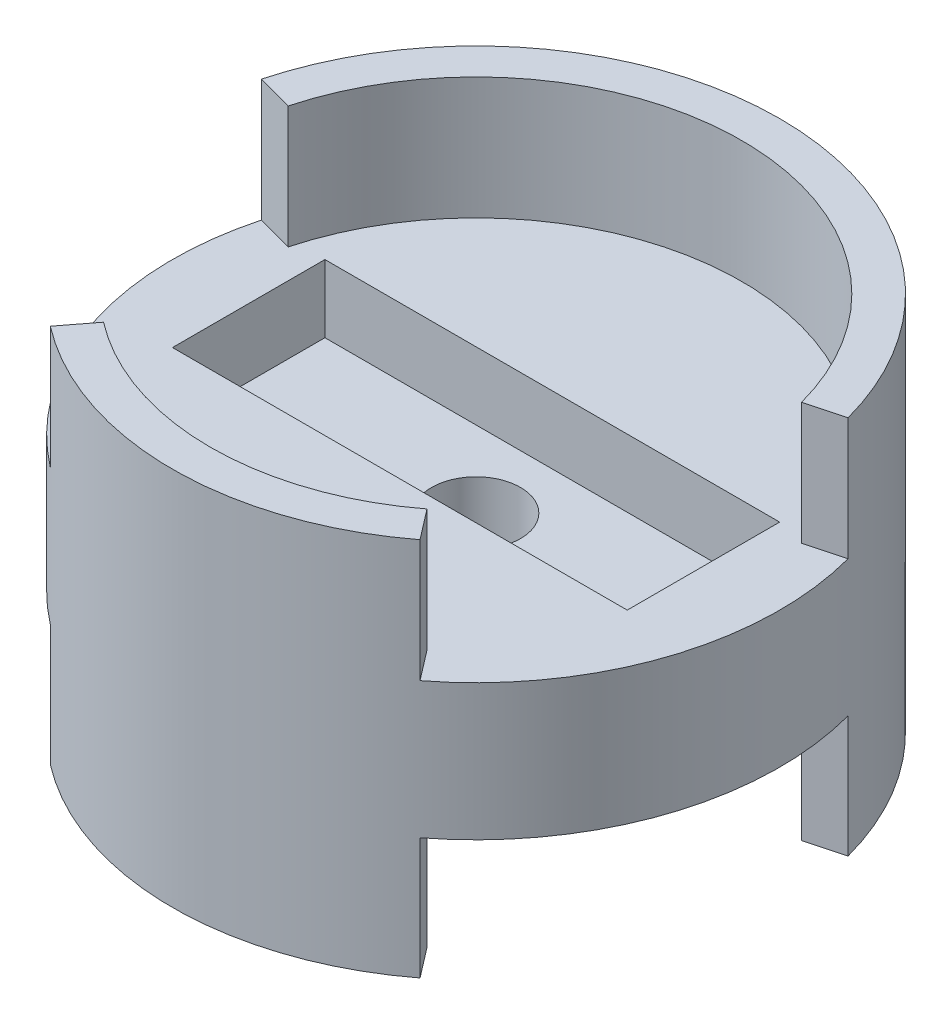
ISO-10303-21;
HEADER;
FILE_DESCRIPTION(('STEP AP214'),'2;1');
FILE_NAME('part.step','',(''),(''),'','','');
FILE_SCHEMA(('AUTOMOTIVE_DESIGN { 1 0 10303 214 1 1 1 1 }'));
ENDSEC;
DATA;
#1=APPLICATION_CONTEXT('core data for automotive mechanical design processes');
#2=APPLICATION_PROTOCOL_DEFINITION('international standard','automotive_design',2000,#1);
#3=PRODUCT_CONTEXT('',#1,'mechanical');
#4=PRODUCT('Part','Part','',(#3));
#5=PRODUCT_RELATED_PRODUCT_CATEGORY('part','',(#4));
#6=PRODUCT_DEFINITION_FORMATION('','',#4);
#7=PRODUCT_DEFINITION_CONTEXT('part definition',#1,'design');
#8=PRODUCT_DEFINITION('design','',#6,#7);
#9=PRODUCT_DEFINITION_SHAPE('','',#8);
#10=(LENGTH_UNIT() NAMED_UNIT(*) SI_UNIT(.MILLI.,.METRE.));
#11=(NAMED_UNIT(*) PLANE_ANGLE_UNIT() SI_UNIT($,.RADIAN.));
#12=(NAMED_UNIT(*) SI_UNIT($,.STERADIAN.) SOLID_ANGLE_UNIT());
#13=UNCERTAINTY_MEASURE_WITH_UNIT(LENGTH_MEASURE(1.E-05),#10,'distance_accuracy_value','');
#14=(GEOMETRIC_REPRESENTATION_CONTEXT(3) GLOBAL_UNCERTAINTY_ASSIGNED_CONTEXT((#13)) GLOBAL_UNIT_ASSIGNED_CONTEXT((#10,
#11,#12)) REPRESENTATION_CONTEXT('',''));
#15=CARTESIAN_POINT('',(0.,0.,0.));
#16=DIRECTION('',(0.,0.,1.));
#17=DIRECTION('',(1.,0.,0.));
#18=AXIS2_PLACEMENT_3D('',#15,#16,#17);
#19=CARTESIAN_POINT('',(0.,5.6642,0.));
#20=DIRECTION('',(0.,1.,0.));
#21=DIRECTION('',(0.,0.,1.));
#22=AXIS2_PLACEMENT_3D('',#19,#20,#21);
#23=PLANE('',#22);
#24=DIRECTION('',(-1.,0.,0.));
#25=VECTOR('',#24,1.);
#26=CARTESIAN_POINT('',(0.,5.6642,6.3754));
#27=LINE('',#26,#25);
#28=CARTESIAN_POINT('',(19.01825,5.6642,6.3754));
#29=VERTEX_POINT('',#28);
#30=CARTESIAN_POINT('',(-19.01825,5.6642,6.3754));
#31=VERTEX_POINT('',#30);
#32=EDGE_CURVE('E278',#29,#31,#27,.T.);
#33=ORIENTED_EDGE('',*,*,#32,.T.);
#34=DIRECTION('',(0.,0.,-1.));
#35=VECTOR('',#34,1.);
#36=CARTESIAN_POINT('',(-19.01825,5.6642,0.));
#37=LINE('',#36,#35);
#38=CARTESIAN_POINT('',(-19.01825,5.6642,-6.3754));
#39=VERTEX_POINT('',#38);
#40=EDGE_CURVE('E281',#31,#39,#37,.T.);
#41=ORIENTED_EDGE('',*,*,#40,.T.);
#42=DIRECTION('',(-1.,0.,0.));
#43=VECTOR('',#42,1.);
#44=CARTESIAN_POINT('',(0.,5.6642,-6.3754));
#45=LINE('',#44,#43);
#46=CARTESIAN_POINT('',(19.01825,5.6642,-6.3754));
#47=VERTEX_POINT('',#46);
#48=EDGE_CURVE('E284',#47,#39,#45,.T.);
#49=ORIENTED_EDGE('',*,*,#48,.F.);
#50=DIRECTION('',(0.,0.,-1.));
#51=VECTOR('',#50,1.);
#52=CARTESIAN_POINT('',(19.01825,5.6642,0.));
#53=LINE('',#52,#51);
#54=EDGE_CURVE('E287',#29,#47,#53,.T.);
#55=ORIENTED_EDGE('',*,*,#54,.F.);
#56=EDGE_LOOP('',(#33,#41,#49,#55));
#57=FACE_BOUND('',#56,.T.);
#58=CARTESIAN_POINT('',(0.,5.6642,0.));
#59=DIRECTION('',(0.,1.,0.));
#60=DIRECTION('',(0.,0.,1.));
#61=AXIS2_PLACEMENT_3D('',#58,#59,#60);
#62=CIRCLE('',#61,25.4);
#63=CARTESIAN_POINT('',(-24.5345159877424,5.6642,-6.57400374560395));
#64=VERTEX_POINT('',#63);
#65=CARTESIAN_POINT('',(-15.4625402968215,5.6642,20.1511748433973));
#66=VERTEX_POINT('',#65);
#67=EDGE_CURVE('E291',#64,#66,#62,.T.);
#68=ORIENTED_EDGE('',*,*,#67,.T.);
#69=DIRECTION('',(0.608761429008722,0.,-0.793353340291234));
#70=VECTOR('',#69,1.);
#71=CARTESIAN_POINT('',(0.,5.6642,0.));
#72=LINE('',#71,#70);
#73=CARTESIAN_POINT('',(-13.5297227597188,5.6642,17.6322779879727));
#74=VERTEX_POINT('',#73);
#75=EDGE_CURVE('E53',#66,#74,#72,.T.);
#76=ORIENTED_EDGE('',*,*,#75,.T.);
#77=CARTESIAN_POINT('',(0.,5.6642,0.));
#78=DIRECTION('',(0.,1.,0.));
#79=DIRECTION('',(0.,0.,1.));
#80=AXIS2_PLACEMENT_3D('',#77,#78,#79);
#81=CIRCLE('',#80,22.225);
#82=CARTESIAN_POINT('',(13.5297227597188,5.6642,17.6322779879727));
#83=VERTEX_POINT('',#82);
#84=EDGE_CURVE('E219',#83,#74,#81,.F.);
#85=ORIENTED_EDGE('',*,*,#84,.F.);
#86=DIRECTION('',(-0.608761429008722,0.,-0.793353340291234));
#87=VECTOR('',#86,1.);
#88=CARTESIAN_POINT('',(0.,5.6642,0.));
#89=LINE('',#88,#87);
#90=CARTESIAN_POINT('',(15.4625402968215,5.6642,20.1511748433973));
#91=VERTEX_POINT('',#90);
#92=EDGE_CURVE('E200',#91,#83,#89,.T.);
#93=ORIENTED_EDGE('',*,*,#92,.F.);
#94=CARTESIAN_POINT('',(24.5345159877424,5.6642,-6.57400374560395));
#95=VERTEX_POINT('',#94);
#96=EDGE_CURVE('E290',#91,#95,#62,.T.);
#97=ORIENTED_EDGE('',*,*,#96,.T.);
#98=DIRECTION('',(-0.965925826289069,0.,0.258819045102518));
#99=VECTOR('',#98,1.);
#100=CARTESIAN_POINT('',(0.,5.6642,0.));
#101=LINE('',#100,#99);
#102=CARTESIAN_POINT('',(21.4677014892746,5.6642,-5.75225327740346));
#103=VERTEX_POINT('',#102);
#104=EDGE_CURVE('E262',#95,#103,#101,.T.);
#105=ORIENTED_EDGE('',*,*,#104,.T.);
#106=CARTESIAN_POINT('',(0.,5.6642,0.));
#107=DIRECTION('',(0.,1.,0.));
#108=DIRECTION('',(0.,0.,1.));
#109=AXIS2_PLACEMENT_3D('',#106,#107,#108);
#110=CIRCLE('',#109,22.225);
#111=CARTESIAN_POINT('',(-21.4677014892746,5.6642,-5.75225327740346));
#112=VERTEX_POINT('',#111);
#113=EDGE_CURVE('E264',#112,#103,#110,.F.);
#114=ORIENTED_EDGE('',*,*,#113,.F.);
#115=DIRECTION('',(0.965925826289069,0.,0.258819045102518));
#116=VECTOR('',#115,1.);
#117=CARTESIAN_POINT('',(0.,5.6642,0.));
#118=LINE('',#117,#116);
#119=EDGE_CURVE('E247',#64,#112,#118,.T.);
#120=ORIENTED_EDGE('',*,*,#119,.F.);
#121=EDGE_LOOP('',(#68,#76,#85,#93,#97,#105,#114,#120));
#122=FACE_BOUND('',#121,.T.);
#123=ADVANCED_FACE('F38',(#57,#122),#23,.T.);
#124=CARTESIAN_POINT('',(0.,-5.715,0.));
#125=DIRECTION('',(0.,1.,0.));
#126=DIRECTION('',(0.,0.,1.));
#127=AXIS2_PLACEMENT_3D('',#124,#125,#126);
#128=PLANE('',#127);
#129=CARTESIAN_POINT('',(0.,-5.715,0.));
#130=DIRECTION('',(0.,1.,0.));
#131=DIRECTION('',(0.,0.,1.));
#132=AXIS2_PLACEMENT_3D('',#129,#130,#131);
#133=CIRCLE('',#132,3.71475);
#134=CARTESIAN_POINT('',(0.,-5.715,3.71475));
#135=VERTEX_POINT('',#134);
#136=EDGE_CURVE('E271',#135,#135,#133,.T.);
#137=ORIENTED_EDGE('',*,*,#136,.T.);
#138=EDGE_LOOP('',(#137));
#139=FACE_BOUND('',#138,.T.);
#140=DIRECTION('',(0.608761429008722,0.,-0.793353340291234));
#141=VECTOR('',#140,1.);
#142=CARTESIAN_POINT('',(0.,-5.715,0.));
#143=LINE('',#142,#141);
#144=CARTESIAN_POINT('',(-15.4625402968215,-5.71499999999999,20.1511748433974));
#145=VERTEX_POINT('',#144);
#146=CARTESIAN_POINT('',(-13.5297227597188,-5.715,17.6322779879727));
#147=VERTEX_POINT('',#146);
#148=EDGE_CURVE('E181',#145,#147,#143,.T.);
#149=ORIENTED_EDGE('',*,*,#148,.F.);
#150=CARTESIAN_POINT('',(0.,-5.715,0.));
#151=DIRECTION('',(0.,1.,0.));
#152=DIRECTION('',(0.,0.,1.));
#153=AXIS2_PLACEMENT_3D('',#150,#151,#152);
#154=CIRCLE('',#153,25.4);
#155=CARTESIAN_POINT('',(-24.5345159877424,-5.715,-6.57400374560395));
#156=VERTEX_POINT('',#155);
#157=EDGE_CURVE('E268',#156,#145,#154,.T.);
#158=ORIENTED_EDGE('',*,*,#157,.F.);
#159=DIRECTION('',(0.965925826289069,0.,0.258819045102518));
#160=VECTOR('',#159,1.);
#161=CARTESIAN_POINT('',(0.,-5.715,0.));
#162=LINE('',#161,#160);
#163=CARTESIAN_POINT('',(-21.4677014892746,-5.715,-5.75225327740346));
#164=VERTEX_POINT('',#163);
#165=EDGE_CURVE('E313',#156,#164,#162,.T.);
#166=ORIENTED_EDGE('',*,*,#165,.T.);
#167=CARTESIAN_POINT('',(0.,-5.715,0.));
#168=DIRECTION('',(0.,1.,0.));
#169=DIRECTION('',(0.,0.,1.));
#170=AXIS2_PLACEMENT_3D('',#167,#168,#169);
#171=CIRCLE('',#170,22.225);
#172=CARTESIAN_POINT('',(21.4677014892746,-5.715,-5.75225327740346));
#173=VERTEX_POINT('',#172);
#174=EDGE_CURVE('E316',#164,#173,#171,.F.);
#175=ORIENTED_EDGE('',*,*,#174,.T.);
#176=DIRECTION('',(-0.965925826289069,0.,0.258819045102518));
#177=VECTOR('',#176,1.);
#178=CARTESIAN_POINT('',(0.,-5.715,0.));
#179=LINE('',#178,#177);
#180=CARTESIAN_POINT('',(24.5345159877424,-5.715,-6.57400374560395));
#181=VERTEX_POINT('',#180);
#182=EDGE_CURVE('E46',#181,#173,#179,.T.);
#183=ORIENTED_EDGE('',*,*,#182,.F.);
#184=CARTESIAN_POINT('',(15.4625402968215,-5.71499999999999,20.1511748433974));
#185=VERTEX_POINT('',#184);
#186=EDGE_CURVE('E272',#185,#181,#154,.T.);
#187=ORIENTED_EDGE('',*,*,#186,.F.);
#188=DIRECTION('',(-0.608761429008722,0.,-0.793353340291234));
#189=VECTOR('',#188,1.);
#190=CARTESIAN_POINT('',(0.,-5.715,0.));
#191=LINE('',#190,#189);
#192=CARTESIAN_POINT('',(13.5297227597188,-5.715,17.6322779879727));
#193=VERTEX_POINT('',#192);
#194=EDGE_CURVE('E196',#185,#193,#191,.T.);
#195=ORIENTED_EDGE('',*,*,#194,.T.);
#196=CARTESIAN_POINT('',(0.,-5.715,0.));
#197=DIRECTION('',(0.,1.,0.));
#198=DIRECTION('',(0.,0.,1.));
#199=AXIS2_PLACEMENT_3D('',#196,#197,#198);
#200=CIRCLE('',#199,22.225);
#201=EDGE_CURVE('E11',#193,#147,#200,.F.);
#202=ORIENTED_EDGE('',*,*,#201,.T.);
#203=EDGE_LOOP('',(#149,#158,#166,#175,#183,#187,#195,#202));
#204=FACE_BOUND('',#203,.T.);
#205=ADVANCED_FACE('F330',(#139,#204),#128,.F.);
#206=CARTESIAN_POINT('',(0.,5.6642,6.3754));
#207=DIRECTION('',(0.,0.,1.));
#208=DIRECTION('',(1.,0.,0.));
#209=AXIS2_PLACEMENT_3D('',#206,#207,#208);
#210=PLANE('',#209);
#211=DIRECTION('',(-1.,0.,0.));
#212=VECTOR('',#211,1.);
#213=CARTESIAN_POINT('',(0.,0.,6.3754));
#214=LINE('',#213,#212);
#215=CARTESIAN_POINT('',(19.01825,0.,6.3754));
#216=VERTEX_POINT('',#215);
#217=CARTESIAN_POINT('',(-19.01825,0.,6.3754));
#218=VERTEX_POINT('',#217);
#219=EDGE_CURVE('E275',#216,#218,#214,.T.);
#220=ORIENTED_EDGE('',*,*,#219,.T.);
#221=DIRECTION('',(0.,-1.,0.));
#222=VECTOR('',#221,1.);
#223=CARTESIAN_POINT('',(-19.01825,5.6642,6.3754));
#224=LINE('',#223,#222);
#225=EDGE_CURVE('E310',#31,#218,#224,.T.);
#226=ORIENTED_EDGE('',*,*,#225,.F.);
#227=ORIENTED_EDGE('',*,*,#32,.F.);
#228=DIRECTION('',(0.,-1.,0.));
#229=VECTOR('',#228,1.);
#230=CARTESIAN_POINT('',(19.01825,5.6642,6.3754));
#231=LINE('',#230,#229);
#232=EDGE_CURVE('E293',#29,#216,#231,.T.);
#233=ORIENTED_EDGE('',*,*,#232,.T.);
#234=EDGE_LOOP('',(#220,#226,#227,#233));
#235=FACE_BOUND('',#234,.T.);
#236=ADVANCED_FACE('F40',(#235),#210,.F.);
#237=CARTESIAN_POINT('',(-19.01825,5.6642,0.));
#238=DIRECTION('',(-1.,0.,0.));
#239=DIRECTION('',(0.,0.,1.));
#240=AXIS2_PLACEMENT_3D('',#237,#238,#239);
#241=PLANE('',#240);
#242=DIRECTION('',(0.,0.,-1.));
#243=VECTOR('',#242,1.);
#244=CARTESIAN_POINT('',(-19.01825,0.,0.));
#245=LINE('',#244,#243);
#246=CARTESIAN_POINT('',(-19.01825,0.,-6.3754));
#247=VERTEX_POINT('',#246);
#248=EDGE_CURVE('E296',#218,#247,#245,.T.);
#249=ORIENTED_EDGE('',*,*,#248,.T.);
#250=DIRECTION('',(0.,-1.,0.));
#251=VECTOR('',#250,1.);
#252=CARTESIAN_POINT('',(-19.01825,5.6642,-6.3754));
#253=LINE('',#252,#251);
#254=EDGE_CURVE('E307',#39,#247,#253,.T.);
#255=ORIENTED_EDGE('',*,*,#254,.F.);
#256=ORIENTED_EDGE('',*,*,#40,.F.);
#257=ORIENTED_EDGE('',*,*,#225,.T.);
#258=EDGE_LOOP('',(#249,#255,#256,#257));
#259=FACE_BOUND('',#258,.T.);
#260=ADVANCED_FACE('F374',(#259),#241,.F.);
#261=CARTESIAN_POINT('',(0.,5.6642,-6.3754));
#262=DIRECTION('',(0.,0.,1.));
#263=DIRECTION('',(1.,0.,0.));
#264=AXIS2_PLACEMENT_3D('',#261,#262,#263);
#265=PLANE('',#264);
#266=DIRECTION('',(-1.,0.,0.));
#267=VECTOR('',#266,1.);
#268=CARTESIAN_POINT('',(0.,0.,-6.3754));
#269=LINE('',#268,#267);
#270=CARTESIAN_POINT('',(19.01825,0.,-6.3754));
#271=VERTEX_POINT('',#270);
#272=EDGE_CURVE('E299',#271,#247,#269,.T.);
#273=ORIENTED_EDGE('',*,*,#272,.F.);
#274=DIRECTION('',(0.,-1.,0.));
#275=VECTOR('',#274,1.);
#276=CARTESIAN_POINT('',(19.01825,5.6642,-6.3754));
#277=LINE('',#276,#275);
#278=EDGE_CURVE('E304',#47,#271,#277,.T.);
#279=ORIENTED_EDGE('',*,*,#278,.F.);
#280=ORIENTED_EDGE('',*,*,#48,.T.);
#281=ORIENTED_EDGE('',*,*,#254,.T.);
#282=EDGE_LOOP('',(#273,#279,#280,#281));
#283=FACE_BOUND('',#282,.T.);
#284=ADVANCED_FACE('F371',(#283),#265,.T.);
#285=CARTESIAN_POINT('',(19.01825,5.6642,0.));
#286=DIRECTION('',(-1.,0.,0.));
#287=DIRECTION('',(0.,0.,1.));
#288=AXIS2_PLACEMENT_3D('',#285,#286,#287);
#289=PLANE('',#288);
#290=DIRECTION('',(0.,0.,-1.));
#291=VECTOR('',#290,1.);
#292=CARTESIAN_POINT('',(19.01825,0.,0.));
#293=LINE('',#292,#291);
#294=EDGE_CURVE('E282',#216,#271,#293,.T.);
#295=ORIENTED_EDGE('',*,*,#294,.F.);
#296=ORIENTED_EDGE('',*,*,#232,.F.);
#297=ORIENTED_EDGE('',*,*,#54,.T.);
#298=ORIENTED_EDGE('',*,*,#278,.T.);
#299=EDGE_LOOP('',(#295,#296,#297,#298));
#300=FACE_BOUND('',#299,.T.);
#301=ADVANCED_FACE('F368',(#300),#289,.T.);
#302=CARTESIAN_POINT('',(0.,5.6642,0.));
#303=DIRECTION('',(0.,-1.,0.));
#304=DIRECTION('',(0.,0.,-1.));
#305=AXIS2_PLACEMENT_3D('',#302,#303,#304);
#306=CYLINDRICAL_SURFACE('',#305,25.4);
#307=ORIENTED_EDGE('',*,*,#157,.T.);
#308=DIRECTION('',(0.,-1.,0.));
#309=VECTOR('',#308,1.);
#310=CARTESIAN_POINT('',(-15.4625402968215,15.875,20.1511748433974));
#311=LINE('',#310,#309);
#312=CARTESIAN_POINT('',(-15.4625402968215,-15.875,20.1511748433974));
#313=VERTEX_POINT('',#312);
#314=EDGE_CURVE('E516',#145,#313,#311,.T.);
#315=ORIENTED_EDGE('',*,*,#314,.T.);
#316=CARTESIAN_POINT('',(0.,-15.875,0.));
#317=DIRECTION('',(0.,1.,0.));
#318=DIRECTION('',(0.,0.,1.));
#319=AXIS2_PLACEMENT_3D('',#316,#317,#318);
#320=CIRCLE('',#319,25.4);
#321=CARTESIAN_POINT('',(15.4625402968215,-15.875,20.1511748433974));
#322=VERTEX_POINT('',#321);
#323=EDGE_CURVE('E192',#313,#322,#320,.T.);
#324=ORIENTED_EDGE('',*,*,#323,.T.);
#325=DIRECTION('',(0.,-1.,0.));
#326=VECTOR('',#325,1.);
#327=CARTESIAN_POINT('',(15.4625402968215,15.875,20.1511748433974));
#328=LINE('',#327,#326);
#329=EDGE_CURVE('E521',#185,#322,#328,.T.);
#330=ORIENTED_EDGE('',*,*,#329,.F.);
#331=ORIENTED_EDGE('',*,*,#186,.T.);
#332=DIRECTION('',(0.,-1.,0.));
#333=VECTOR('',#332,1.);
#334=CARTESIAN_POINT('',(24.5345159877424,15.875,-6.57400374560395));
#335=LINE('',#334,#333);
#336=CARTESIAN_POINT('',(24.5345159877424,-15.875,-6.57400374560395));
#337=VERTEX_POINT('',#336);
#338=EDGE_CURVE('E252',#181,#337,#335,.T.);
#339=ORIENTED_EDGE('',*,*,#338,.T.);
#340=CARTESIAN_POINT('',(0.,-15.875,0.));
#341=DIRECTION('',(0.,1.,0.));
#342=DIRECTION('',(0.,0.,1.));
#343=AXIS2_PLACEMENT_3D('',#340,#341,#342);
#344=CIRCLE('',#343,25.4);
#345=CARTESIAN_POINT('',(-24.5345159877424,-15.875,-6.57400374560395));
#346=VERTEX_POINT('',#345);
#347=EDGE_CURVE('E239',#337,#346,#344,.T.);
#348=ORIENTED_EDGE('',*,*,#347,.T.);
#349=DIRECTION('',(0.,-1.,0.));
#350=VECTOR('',#349,1.);
#351=CARTESIAN_POINT('',(-24.5345159877424,15.875,-6.57400374560395));
#352=LINE('',#351,#350);
#353=EDGE_CURVE('E256',#156,#346,#352,.T.);
#354=ORIENTED_EDGE('',*,*,#353,.F.);
#355=EDGE_LOOP('',(#307,#315,#324,#330,#331,#339,#348,#354));
#356=FACE_BOUND('',#355,.T.);
#357=ORIENTED_EDGE('',*,*,#96,.F.);
#358=CARTESIAN_POINT('',(15.4625402968215,15.875,20.1511748433974));
#359=VERTEX_POINT('',#358);
#360=EDGE_CURVE('E526',#359,#91,#328,.T.);
#361=ORIENTED_EDGE('',*,*,#360,.F.);
#362=CARTESIAN_POINT('',(0.,15.875,0.));
#363=DIRECTION('',(0.,1.,0.));
#364=DIRECTION('',(0.,0.,1.));
#365=AXIS2_PLACEMENT_3D('',#362,#363,#364);
#366=CIRCLE('',#365,25.4);
#367=CARTESIAN_POINT('',(-15.4625402968215,15.875,20.1511748433974));
#368=VERTEX_POINT('',#367);
#369=EDGE_CURVE('E207',#368,#359,#366,.T.);
#370=ORIENTED_EDGE('',*,*,#369,.F.);
#371=EDGE_CURVE('E518',#368,#66,#311,.T.);
#372=ORIENTED_EDGE('',*,*,#371,.T.);
#373=ORIENTED_EDGE('',*,*,#67,.F.);
#374=CARTESIAN_POINT('',(-24.5345159877424,15.875,-6.57400374560395));
#375=VERTEX_POINT('',#374);
#376=EDGE_CURVE('E253',#375,#64,#352,.T.);
#377=ORIENTED_EDGE('',*,*,#376,.F.);
#378=CARTESIAN_POINT('',(0.,15.875,0.));
#379=DIRECTION('',(0.,1.,0.));
#380=DIRECTION('',(0.,0.,1.));
#381=AXIS2_PLACEMENT_3D('',#378,#379,#380);
#382=CIRCLE('',#381,25.4);
#383=CARTESIAN_POINT('',(24.5345159877424,15.875,-6.57400374560395));
#384=VERTEX_POINT('',#383);
#385=EDGE_CURVE('E229',#384,#375,#382,.T.);
#386=ORIENTED_EDGE('',*,*,#385,.F.);
#387=EDGE_CURVE('E249',#384,#95,#335,.T.);
#388=ORIENTED_EDGE('',*,*,#387,.T.);
#389=EDGE_LOOP('',(#357,#361,#370,#372,#373,#377,#386,#388));
#390=FACE_BOUND('',#389,.T.);
#391=ADVANCED_FACE('F337',(#356,#390),#306,.T.);
#392=CARTESIAN_POINT('',(0.,0.,0.));
#393=DIRECTION('',(0.,1.,0.));
#394=DIRECTION('',(0.,0.,1.));
#395=AXIS2_PLACEMENT_3D('',#392,#393,#394);
#396=PLANE('',#395);
#397=CARTESIAN_POINT('',(0.,0.,0.));
#398=DIRECTION('',(0.,1.,0.));
#399=DIRECTION('',(0.,0.,1.));
#400=AXIS2_PLACEMENT_3D('',#397,#398,#399);
#401=CIRCLE('',#400,3.71475);
#402=CARTESIAN_POINT('',(0.,0.,3.71475));
#403=VERTEX_POINT('',#402);
#404=EDGE_CURVE('E267',#403,#403,#401,.T.);
#405=ORIENTED_EDGE('',*,*,#404,.F.);
#406=EDGE_LOOP('',(#405));
#407=FACE_BOUND('',#406,.T.);
#408=ORIENTED_EDGE('',*,*,#219,.F.);
#409=ORIENTED_EDGE('',*,*,#294,.T.);
#410=ORIENTED_EDGE('',*,*,#272,.T.);
#411=ORIENTED_EDGE('',*,*,#248,.F.);
#412=EDGE_LOOP('',(#408,#409,#410,#411));
#413=FACE_BOUND('',#412,.T.);
#414=ADVANCED_FACE('F351',(#407,#413),#396,.T.);
#415=CARTESIAN_POINT('',(0.,-5.715,0.));
#416=DIRECTION('',(0.,1.,0.));
#417=DIRECTION('',(0.,0.,1.));
#418=AXIS2_PLACEMENT_3D('',#415,#416,#417);
#419=CYLINDRICAL_SURFACE('',#418,3.71475);
#420=ORIENTED_EDGE('',*,*,#136,.F.);
#421=EDGE_LOOP('',(#420));
#422=FACE_BOUND('',#421,.T.);
#423=ORIENTED_EDGE('',*,*,#404,.T.);
#424=EDGE_LOOP('',(#423));
#425=FACE_BOUND('',#424,.T.);
#426=ADVANCED_FACE('F343',(#422,#425),#419,.F.);
#427=CARTESIAN_POINT('',(0.,-15.875,0.));
#428=DIRECTION('',(0.,1.,0.));
#429=DIRECTION('',(0.,0.,1.));
#430=AXIS2_PLACEMENT_3D('',#427,#428,#429);
#431=PLANE('',#430);
#432=CARTESIAN_POINT('',(0.,-15.875,0.));
#433=DIRECTION('',(0.,1.,0.));
#434=DIRECTION('',(0.,0.,1.));
#435=AXIS2_PLACEMENT_3D('',#432,#433,#434);
#436=CIRCLE('',#435,22.225);
#437=CARTESIAN_POINT('',(21.4677014892746,-15.875,-5.75225327740346));
#438=VERTEX_POINT('',#437);
#439=CARTESIAN_POINT('',(-21.4677014892746,-15.875,-5.75225327740346));
#440=VERTEX_POINT('',#439);
#441=EDGE_CURVE('E221',#438,#440,#436,.T.);
#442=ORIENTED_EDGE('',*,*,#441,.T.);
#443=DIRECTION('',(-0.965925826289069,0.,-0.258819045102518));
#444=VECTOR('',#443,1.);
#445=CARTESIAN_POINT('',(-21.4677014892746,-15.875,-5.75225327740346));
#446=LINE('',#445,#444);
#447=EDGE_CURVE('E236',#440,#346,#446,.T.);
#448=ORIENTED_EDGE('',*,*,#447,.T.);
#449=ORIENTED_EDGE('',*,*,#347,.F.);
#450=DIRECTION('',(0.965925826289069,0.,-0.258819045102518));
#451=VECTOR('',#450,1.);
#452=CARTESIAN_POINT('',(21.4677014892746,-15.875,-5.75225327740346));
#453=LINE('',#452,#451);
#454=EDGE_CURVE('E226',#438,#337,#453,.T.);
#455=ORIENTED_EDGE('',*,*,#454,.F.);
#456=EDGE_LOOP('',(#442,#448,#449,#455));
#457=FACE_BOUND('',#456,.T.);
#458=ADVANCED_FACE('F341',(#457),#431,.F.);
#459=CARTESIAN_POINT('',(-21.4677014892746,15.875,-5.75225327740346));
#460=DIRECTION('',(-0.258819045102518,0.,0.965925826289069));
#461=DIRECTION('',(0.965925826289069,0.,0.258819045102518));
#462=AXIS2_PLACEMENT_3D('',#459,#460,#461);
#463=PLANE('',#462);
#464=ORIENTED_EDGE('',*,*,#165,.F.);
#465=ORIENTED_EDGE('',*,*,#353,.T.);
#466=ORIENTED_EDGE('',*,*,#447,.F.);
#467=DIRECTION('',(0.,-1.,0.));
#468=VECTOR('',#467,1.);
#469=CARTESIAN_POINT('',(-21.4677014892746,15.875,-5.75225327740346));
#470=LINE('',#469,#468);
#471=EDGE_CURVE('E233',#164,#440,#470,.T.);
#472=ORIENTED_EDGE('',*,*,#471,.F.);
#473=EDGE_LOOP('',(#464,#465,#466,#472));
#474=FACE_BOUND('',#473,.T.);
#475=ADVANCED_FACE('F334',(#474),#463,.T.);
#476=CARTESIAN_POINT('',(21.4677014892746,15.875,-5.75225327740346));
#477=DIRECTION('',(-0.258819045102518,0.,-0.965925826289069));
#478=DIRECTION('',(-0.965925826289069,0.,0.258819045102518));
#479=AXIS2_PLACEMENT_3D('',#476,#477,#478);
#480=PLANE('',#479);
#481=ORIENTED_EDGE('',*,*,#338,.F.);
#482=ORIENTED_EDGE('',*,*,#182,.T.);
#483=DIRECTION('',(0.,-1.,0.));
#484=VECTOR('',#483,1.);
#485=CARTESIAN_POINT('',(21.4677014892746,15.875,-5.75225327740346));
#486=LINE('',#485,#484);
#487=EDGE_CURVE('E248',#173,#438,#486,.T.);
#488=ORIENTED_EDGE('',*,*,#487,.T.);
#489=ORIENTED_EDGE('',*,*,#454,.T.);
#490=EDGE_LOOP('',(#481,#482,#488,#489));
#491=FACE_BOUND('',#490,.T.);
#492=ADVANCED_FACE('F322',(#491),#480,.F.);
#493=CARTESIAN_POINT('',(0.,15.875,0.));
#494=DIRECTION('',(0.,-1.,0.));
#495=DIRECTION('',(0.,0.,-1.));
#496=AXIS2_PLACEMENT_3D('',#493,#494,#495);
#497=CYLINDRICAL_SURFACE('',#496,22.225);
#498=ORIENTED_EDGE('',*,*,#174,.F.);
#499=ORIENTED_EDGE('',*,*,#471,.T.);
#500=ORIENTED_EDGE('',*,*,#441,.F.);
#501=ORIENTED_EDGE('',*,*,#487,.F.);
#502=EDGE_LOOP('',(#498,#499,#500,#501));
#503=FACE_BOUND('',#502,.T.);
#504=ADVANCED_FACE('F329',(#503),#497,.F.);
#505=CARTESIAN_POINT('',(-21.4677014892746,15.875,-5.75225327740346));
#506=VERTEX_POINT('',#505);
#507=EDGE_CURVE('E257',#506,#112,#470,.T.);
#508=ORIENTED_EDGE('',*,*,#507,.T.);
#509=ORIENTED_EDGE('',*,*,#113,.T.);
#510=CARTESIAN_POINT('',(21.4677014892746,15.875,-5.75225327740346));
#511=VERTEX_POINT('',#510);
#512=EDGE_CURVE('E244',#511,#103,#486,.T.);
#513=ORIENTED_EDGE('',*,*,#512,.F.);
#514=CARTESIAN_POINT('',(0.,15.875,0.));
#515=DIRECTION('',(0.,1.,0.));
#516=DIRECTION('',(0.,0.,1.));
#517=AXIS2_PLACEMENT_3D('',#514,#515,#516);
#518=CIRCLE('',#517,22.225);
#519=EDGE_CURVE('E222',#511,#506,#518,.T.);
#520=ORIENTED_EDGE('',*,*,#519,.T.);
#521=EDGE_LOOP('',(#508,#509,#513,#520));
#522=FACE_BOUND('',#521,.T.);
#523=ADVANCED_FACE('F396',(#522),#497,.F.);
#524=ORIENTED_EDGE('',*,*,#104,.F.);
#525=ORIENTED_EDGE('',*,*,#387,.F.);
#526=DIRECTION('',(0.965925826289069,0.,-0.258819045102518));
#527=VECTOR('',#526,1.);
#528=CARTESIAN_POINT('',(21.4677014892746,15.875,-5.75225327740346));
#529=LINE('',#528,#527);
#530=EDGE_CURVE('E231',#511,#384,#529,.T.);
#531=ORIENTED_EDGE('',*,*,#530,.F.);
#532=ORIENTED_EDGE('',*,*,#512,.T.);
#533=EDGE_LOOP('',(#524,#525,#531,#532));
#534=FACE_BOUND('',#533,.T.);
#535=ADVANCED_FACE('F398',(#534),#480,.F.);
#536=ORIENTED_EDGE('',*,*,#376,.T.);
#537=ORIENTED_EDGE('',*,*,#119,.T.);
#538=ORIENTED_EDGE('',*,*,#507,.F.);
#539=DIRECTION('',(-0.965925826289069,0.,-0.258819045102518));
#540=VECTOR('',#539,1.);
#541=CARTESIAN_POINT('',(-21.4677014892746,15.875,-5.75225327740346));
#542=LINE('',#541,#540);
#543=EDGE_CURVE('E225',#506,#375,#542,.T.);
#544=ORIENTED_EDGE('',*,*,#543,.T.);
#545=EDGE_LOOP('',(#536,#537,#538,#544));
#546=FACE_BOUND('',#545,.T.);
#547=ADVANCED_FACE('F350',(#546),#463,.T.);
#548=CARTESIAN_POINT('',(0.,15.875,0.));
#549=DIRECTION('',(0.,1.,0.));
#550=DIRECTION('',(0.,0.,1.));
#551=AXIS2_PLACEMENT_3D('',#548,#549,#550);
#552=PLANE('',#551);
#553=ORIENTED_EDGE('',*,*,#519,.F.);
#554=ORIENTED_EDGE('',*,*,#530,.T.);
#555=ORIENTED_EDGE('',*,*,#385,.T.);
#556=ORIENTED_EDGE('',*,*,#543,.F.);
#557=EDGE_LOOP('',(#553,#554,#555,#556));
#558=FACE_BOUND('',#557,.T.);
#559=ADVANCED_FACE('F401',(#558),#552,.T.);
#560=CARTESIAN_POINT('',(0.,-15.875,0.));
#561=DIRECTION('',(0.,1.,0.));
#562=DIRECTION('',(0.,0.,1.));
#563=AXIS2_PLACEMENT_3D('',#560,#561,#562);
#564=PLANE('',#563);
#565=CARTESIAN_POINT('',(0.,-15.875,0.));
#566=DIRECTION('',(0.,1.,0.));
#567=DIRECTION('',(0.,0.,1.));
#568=AXIS2_PLACEMENT_3D('',#565,#566,#567);
#569=CIRCLE('',#568,22.225);
#570=CARTESIAN_POINT('',(-13.5297227597188,-15.875,17.6322779879727));
#571=VERTEX_POINT('',#570);
#572=CARTESIAN_POINT('',(13.5297227597188,-15.875,17.6322779879727));
#573=VERTEX_POINT('',#572);
#574=EDGE_CURVE('E190',#571,#573,#569,.T.);
#575=ORIENTED_EDGE('',*,*,#574,.T.);
#576=DIRECTION('',(0.608761429008722,0.,0.793353340291234));
#577=VECTOR('',#576,1.);
#578=CARTESIAN_POINT('',(13.5297227597188,-15.875,17.6322779879727));
#579=LINE('',#578,#577);
#580=EDGE_CURVE('E197',#573,#322,#579,.T.);
#581=ORIENTED_EDGE('',*,*,#580,.T.);
#582=ORIENTED_EDGE('',*,*,#323,.F.);
#583=DIRECTION('',(-0.608761429008722,0.,0.793353340291234));
#584=VECTOR('',#583,1.);
#585=CARTESIAN_POINT('',(-13.5297227597188,-15.875,17.6322779879727));
#586=LINE('',#585,#584);
#587=EDGE_CURVE('E178',#571,#313,#586,.T.);
#588=ORIENTED_EDGE('',*,*,#587,.F.);
#589=EDGE_LOOP('',(#575,#581,#582,#588));
#590=FACE_BOUND('',#589,.T.);
#591=ADVANCED_FACE('F188',(#590),#564,.F.);
#592=CARTESIAN_POINT('',(13.5297227597188,15.875,17.6322779879727));
#593=DIRECTION('',(0.793353340291234,0.,-0.608761429008722));
#594=DIRECTION('',(-0.608761429008722,0.,-0.793353340291234));
#595=AXIS2_PLACEMENT_3D('',#592,#593,#594);
#596=PLANE('',#595);
#597=ORIENTED_EDGE('',*,*,#194,.F.);
#598=ORIENTED_EDGE('',*,*,#329,.T.);
#599=ORIENTED_EDGE('',*,*,#580,.F.);
#600=DIRECTION('',(0.,-1.,0.));
#601=VECTOR('',#600,1.);
#602=CARTESIAN_POINT('',(13.5297227597188,15.875,17.6322779879727));
#603=LINE('',#602,#601);
#604=EDGE_CURVE('E61',#193,#573,#603,.T.);
#605=ORIENTED_EDGE('',*,*,#604,.F.);
#606=EDGE_LOOP('',(#597,#598,#599,#605));
#607=FACE_BOUND('',#606,.T.);
#608=ADVANCED_FACE('F445',(#607),#596,.T.);
#609=CARTESIAN_POINT('',(-13.5297227597188,15.875,17.6322779879727));
#610=DIRECTION('',(0.793353340291234,0.,0.608761429008722));
#611=DIRECTION('',(0.608761429008722,0.,-0.793353340291234));
#612=AXIS2_PLACEMENT_3D('',#609,#610,#611);
#613=PLANE('',#612);
#614=ORIENTED_EDGE('',*,*,#314,.F.);
#615=ORIENTED_EDGE('',*,*,#148,.T.);
#616=DIRECTION('',(0.,-1.,0.));
#617=VECTOR('',#616,1.);
#618=CARTESIAN_POINT('',(-13.5297227597188,15.875,17.6322779879727));
#619=LINE('',#618,#617);
#620=EDGE_CURVE('E175',#147,#571,#619,.T.);
#621=ORIENTED_EDGE('',*,*,#620,.T.);
#622=ORIENTED_EDGE('',*,*,#587,.T.);
#623=EDGE_LOOP('',(#614,#615,#621,#622));
#624=FACE_BOUND('',#623,.T.);
#625=ADVANCED_FACE('F177',(#624),#613,.F.);
#626=CARTESIAN_POINT('',(0.,15.875,0.));
#627=DIRECTION('',(0.,-1.,0.));
#628=DIRECTION('',(0.,0.,-1.));
#629=AXIS2_PLACEMENT_3D('',#626,#627,#628);
#630=CYLINDRICAL_SURFACE('',#629,22.225);
#631=ORIENTED_EDGE('',*,*,#201,.F.);
#632=ORIENTED_EDGE('',*,*,#604,.T.);
#633=ORIENTED_EDGE('',*,*,#574,.F.);
#634=ORIENTED_EDGE('',*,*,#620,.F.);
#635=EDGE_LOOP('',(#631,#632,#633,#634));
#636=FACE_BOUND('',#635,.T.);
#637=ADVANCED_FACE('F195',(#636),#630,.F.);
#638=CARTESIAN_POINT('',(13.5297227597188,15.875,17.6322779879727));
#639=VERTEX_POINT('',#638);
#640=EDGE_CURVE('E208',#639,#83,#603,.T.);
#641=ORIENTED_EDGE('',*,*,#640,.T.);
#642=ORIENTED_EDGE('',*,*,#84,.T.);
#643=CARTESIAN_POINT('',(-13.5297227597188,15.875,17.6322779879727));
#644=VERTEX_POINT('',#643);
#645=EDGE_CURVE('E184',#644,#74,#619,.T.);
#646=ORIENTED_EDGE('',*,*,#645,.F.);
#647=CARTESIAN_POINT('',(0.,15.875,0.));
#648=DIRECTION('',(0.,1.,0.));
#649=DIRECTION('',(0.,0.,1.));
#650=AXIS2_PLACEMENT_3D('',#647,#648,#649);
#651=CIRCLE('',#650,22.225);
#652=EDGE_CURVE('E193',#644,#639,#651,.T.);
#653=ORIENTED_EDGE('',*,*,#652,.T.);
#654=EDGE_LOOP('',(#641,#642,#646,#653));
#655=FACE_BOUND('',#654,.T.);
#656=ADVANCED_FACE('F472',(#655),#630,.F.);
#657=ORIENTED_EDGE('',*,*,#75,.F.);
#658=ORIENTED_EDGE('',*,*,#371,.F.);
#659=DIRECTION('',(-0.608761429008722,0.,0.793353340291234));
#660=VECTOR('',#659,1.);
#661=CARTESIAN_POINT('',(-13.5297227597188,15.875,17.6322779879727));
#662=LINE('',#661,#660);
#663=EDGE_CURVE('E205',#644,#368,#662,.T.);
#664=ORIENTED_EDGE('',*,*,#663,.F.);
#665=ORIENTED_EDGE('',*,*,#645,.T.);
#666=EDGE_LOOP('',(#657,#658,#664,#665));
#667=FACE_BOUND('',#666,.T.);
#668=ADVANCED_FACE('F464',(#667),#613,.F.);
#669=ORIENTED_EDGE('',*,*,#360,.T.);
#670=ORIENTED_EDGE('',*,*,#92,.T.);
#671=ORIENTED_EDGE('',*,*,#640,.F.);
#672=DIRECTION('',(0.608761429008722,0.,0.793353340291234));
#673=VECTOR('',#672,1.);
#674=CARTESIAN_POINT('',(13.5297227597188,15.875,17.6322779879727));
#675=LINE('',#674,#673);
#676=EDGE_CURVE('E210',#639,#359,#675,.T.);
#677=ORIENTED_EDGE('',*,*,#676,.T.);
#678=EDGE_LOOP('',(#669,#670,#671,#677));
#679=FACE_BOUND('',#678,.T.);
#680=ADVANCED_FACE('F455',(#679),#596,.T.);
#681=CARTESIAN_POINT('',(0.,15.875,0.));
#682=DIRECTION('',(0.,1.,0.));
#683=DIRECTION('',(0.,0.,1.));
#684=AXIS2_PLACEMENT_3D('',#681,#682,#683);
#685=PLANE('',#684);
#686=ORIENTED_EDGE('',*,*,#652,.F.);
#687=ORIENTED_EDGE('',*,*,#663,.T.);
#688=ORIENTED_EDGE('',*,*,#369,.T.);
#689=ORIENTED_EDGE('',*,*,#676,.F.);
#690=EDGE_LOOP('',(#686,#687,#688,#689));
#691=FACE_BOUND('',#690,.T.);
#692=ADVANCED_FACE('F497',(#691),#685,.T.);
#693=CLOSED_SHELL('',(#123,#205,#236,#260,#284,#301,#391,#414,#426,#458,#475,#492,#504,#523,
#535,#547,#559,#591,#608,#625,#637,#656,#668,#680,#692));
#694=MANIFOLD_SOLID_BREP('B2',#693);
#695=ADVANCED_BREP_SHAPE_REPRESENTATION('',(#18,#694),#14);
#696=SHAPE_DEFINITION_REPRESENTATION(#9,#695);
ENDSEC;
END-ISO-10303-21;
